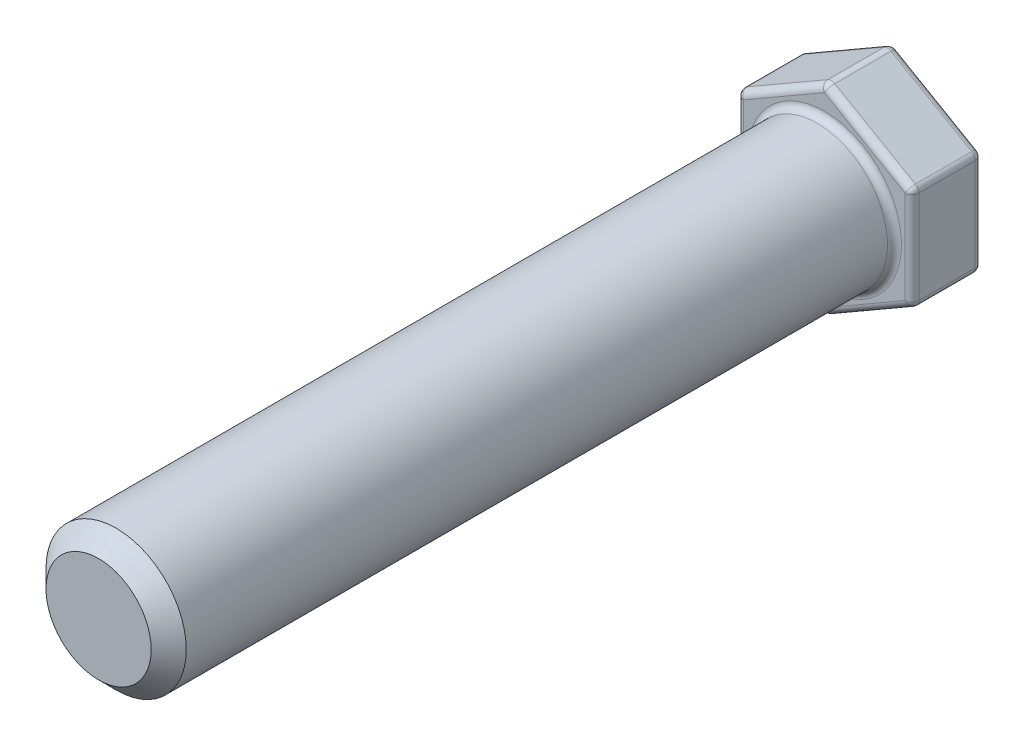
ISO-10303-21;
HEADER;
FILE_DESCRIPTION(('STEP AP214'),'2;1');
FILE_NAME('part.step','',(''),(''),'','','');
FILE_SCHEMA(('AUTOMOTIVE_DESIGN { 1 0 10303 214 1 1 1 1 }'));
ENDSEC;
DATA;
#1=APPLICATION_CONTEXT('core data for automotive mechanical design processes');
#2=APPLICATION_PROTOCOL_DEFINITION('international standard','automotive_design',2000,#1);
#3=PRODUCT_CONTEXT('',#1,'mechanical');
#4=PRODUCT('Part','Part','',(#3));
#5=PRODUCT_RELATED_PRODUCT_CATEGORY('part','',(#4));
#6=PRODUCT_DEFINITION_FORMATION('','',#4);
#7=PRODUCT_DEFINITION_CONTEXT('part definition',#1,'design');
#8=PRODUCT_DEFINITION('design','',#6,#7);
#9=PRODUCT_DEFINITION_SHAPE('','',#8);
#10=(LENGTH_UNIT() NAMED_UNIT(*) SI_UNIT(.MILLI.,.METRE.));
#11=(NAMED_UNIT(*) PLANE_ANGLE_UNIT() SI_UNIT($,.RADIAN.));
#12=(NAMED_UNIT(*) SI_UNIT($,.STERADIAN.) SOLID_ANGLE_UNIT());
#13=UNCERTAINTY_MEASURE_WITH_UNIT(LENGTH_MEASURE(1.E-05),#10,'distance_accuracy_value','');
#14=(GEOMETRIC_REPRESENTATION_CONTEXT(3) GLOBAL_UNCERTAINTY_ASSIGNED_CONTEXT((#13)) GLOBAL_UNIT_ASSIGNED_CONTEXT((#10,
#11,#12)) REPRESENTATION_CONTEXT('',''));
#15=CARTESIAN_POINT('',(0.,0.,0.));
#16=DIRECTION('',(0.,0.,1.));
#17=DIRECTION('',(1.,0.,0.));
#18=AXIS2_PLACEMENT_3D('',#15,#16,#17);
#19=CARTESIAN_POINT('',(0.,0.,20.7));
#20=DIRECTION('',(0.,0.,-1.));
#21=DIRECTION('',(-1.,0.,0.));
#22=AXIS2_PLACEMENT_3D('',#19,#20,#21);
#23=CYLINDRICAL_SURFACE('',#22,2.);
#24=CARTESIAN_POINT('',(0.,0.,20.2));
#25=DIRECTION('',(0.,0.,1.));
#26=DIRECTION('',(1.,0.,0.));
#27=AXIS2_PLACEMENT_3D('',#24,#25,#26);
#28=CIRCLE('',#27,2.);
#29=CARTESIAN_POINT('',(2.,0.,20.2));
#30=VERTEX_POINT('',#29);
#31=EDGE_CURVE('E11',#30,#30,#28,.F.);
#32=ORIENTED_EDGE('',*,*,#31,.T.);
#33=EDGE_LOOP('',(#32));
#34=FACE_BOUND('',#33,.T.);
#35=CARTESIAN_POINT('',(0.,0.,0.199999999999999));
#36=DIRECTION('',(0.,0.,-1.));
#37=DIRECTION('',(-1.,0.,0.));
#38=AXIS2_PLACEMENT_3D('',#35,#36,#37);
#39=CIRCLE('',#38,2.);
#40=CARTESIAN_POINT('',(-2.,0.,0.199999999999999));
#41=VERTEX_POINT('',#40);
#42=EDGE_CURVE('E291',#41,#41,#39,.F.);
#43=ORIENTED_EDGE('',*,*,#42,.T.);
#44=EDGE_LOOP('',(#43));
#45=FACE_BOUND('',#44,.T.);
#46=ADVANCED_FACE('F41',(#34,#45),#23,.T.);
#47=CARTESIAN_POINT('',(0.,0.,20.7));
#48=DIRECTION('',(0.,0.,1.));
#49=DIRECTION('',(1.,0.,0.));
#50=AXIS2_PLACEMENT_3D('',#47,#48,#49);
#51=PLANE('',#50);
#52=CARTESIAN_POINT('',(0.,0.,20.7));
#53=DIRECTION('',(0.,0.,1.));
#54=DIRECTION('',(1.,0.,0.));
#55=AXIS2_PLACEMENT_3D('',#52,#53,#54);
#56=CIRCLE('',#55,1.5);
#57=CARTESIAN_POINT('',(1.5,0.,20.7));
#58=VERTEX_POINT('',#57);
#59=EDGE_CURVE('E50',#58,#58,#56,.T.);
#60=ORIENTED_EDGE('',*,*,#59,.T.);
#61=EDGE_LOOP('',(#60));
#62=FACE_BOUND('',#61,.T.);
#63=ADVANCED_FACE('F440',(#62),#51,.T.);
#64=CARTESIAN_POINT('',(0.,2.88675134594813,-2.));
#65=DIRECTION('',(-0.500000000000001,-0.866025403784438,0.));
#66=DIRECTION('',(0.866025403784438,-0.500000000000001,0.));
#67=AXIS2_PLACEMENT_3D('',#64,#65,#66);
#68=PLANE('',#67);
#69=DIRECTION('',(0.866025403784438,-0.500000000000001,0.));
#70=VECTOR('',#69,1.);
#71=CARTESIAN_POINT('',(0.,2.88675134594813,-1.8));
#72=LINE('',#71,#70);
#73=CARTESIAN_POINT('',(2.4,1.50111069989303,-1.8));
#74=VERTEX_POINT('',#73);
#75=CARTESIAN_POINT('',(0.100000000000001,2.82901631902917,-1.8));
#76=VERTEX_POINT('',#75);
#77=EDGE_CURVE('E260',#74,#76,#72,.F.);
#78=ORIENTED_EDGE('',*,*,#77,.T.);
#79=DIRECTION('',(0.,0.,1.));
#80=VECTOR('',#79,1.);
#81=CARTESIAN_POINT('',(0.100000000000001,2.82901631902917,-2.));
#82=LINE('',#81,#80);
#83=CARTESIAN_POINT('',(0.100000000000001,2.82901631902917,-0.2));
#84=VERTEX_POINT('',#83);
#85=EDGE_CURVE('E363',#76,#84,#82,.T.);
#86=ORIENTED_EDGE('',*,*,#85,.T.);
#87=DIRECTION('',(0.866025403784438,-0.500000000000001,0.));
#88=VECTOR('',#87,1.);
#89=CARTESIAN_POINT('',(0.,2.88675134594813,-0.2));
#90=LINE('',#89,#88);
#91=CARTESIAN_POINT('',(2.4,1.50111069989303,-0.2));
#92=VERTEX_POINT('',#91);
#93=EDGE_CURVE('E256',#84,#92,#90,.T.);
#94=ORIENTED_EDGE('',*,*,#93,.T.);
#95=DIRECTION('',(0.,0.,1.));
#96=VECTOR('',#95,1.);
#97=CARTESIAN_POINT('',(2.4,1.50111069989303,-2.));
#98=LINE('',#97,#96);
#99=EDGE_CURVE('E360',#92,#74,#98,.F.);
#100=ORIENTED_EDGE('',*,*,#99,.T.);
#101=EDGE_LOOP('',(#78,#86,#94,#100));
#102=FACE_BOUND('',#101,.T.);
#103=ADVANCED_FACE('F458',(#102),#68,.F.);
#104=CARTESIAN_POINT('',(2.5,1.44337567297406,-2.));
#105=DIRECTION('',(-1.,0.,0.));
#106=DIRECTION('',(0.,0.,1.));
#107=AXIS2_PLACEMENT_3D('',#104,#105,#106);
#108=PLANE('',#107);
#109=DIRECTION('',(0.,-1.,0.));
#110=VECTOR('',#109,1.);
#111=CARTESIAN_POINT('',(2.5,1.44337567297406,-0.2));
#112=LINE('',#111,#110);
#113=CARTESIAN_POINT('',(2.5,1.32790561913614,-0.2));
#114=VERTEX_POINT('',#113);
#115=CARTESIAN_POINT('',(2.5,-1.32790561913614,-0.2));
#116=VERTEX_POINT('',#115);
#117=EDGE_CURVE('E250',#114,#116,#112,.T.);
#118=ORIENTED_EDGE('',*,*,#117,.T.);
#119=DIRECTION('',(0.,0.,1.));
#120=VECTOR('',#119,1.);
#121=CARTESIAN_POINT('',(2.5,-1.32790561913614,-2.));
#122=LINE('',#121,#120);
#123=CARTESIAN_POINT('',(2.5,-1.32790561913614,-1.8));
#124=VERTEX_POINT('',#123);
#125=EDGE_CURVE('E392',#116,#124,#122,.F.);
#126=ORIENTED_EDGE('',*,*,#125,.T.);
#127=DIRECTION('',(0.,-1.,0.));
#128=VECTOR('',#127,1.);
#129=CARTESIAN_POINT('',(2.5,1.44337567297406,-1.8));
#130=LINE('',#129,#128);
#131=CARTESIAN_POINT('',(2.5,1.32790561913614,-1.8));
#132=VERTEX_POINT('',#131);
#133=EDGE_CURVE('E253',#124,#132,#130,.F.);
#134=ORIENTED_EDGE('',*,*,#133,.T.);
#135=DIRECTION('',(0.,0.,1.));
#136=VECTOR('',#135,1.);
#137=CARTESIAN_POINT('',(2.5,1.32790561913614,-2.));
#138=LINE('',#137,#136);
#139=EDGE_CURVE('E64',#132,#114,#138,.T.);
#140=ORIENTED_EDGE('',*,*,#139,.T.);
#141=EDGE_LOOP('',(#118,#126,#134,#140));
#142=FACE_BOUND('',#141,.T.);
#143=ADVANCED_FACE('F624',(#142),#108,.F.);
#144=CARTESIAN_POINT('',(2.5,-1.44337567297406,-2.));
#145=DIRECTION('',(-0.5,0.866025403784439,0.));
#146=DIRECTION('',(-0.866025403784439,-0.5,0.));
#147=AXIS2_PLACEMENT_3D('',#144,#145,#146);
#148=PLANE('',#147);
#149=DIRECTION('',(-0.866025403784439,-0.5,0.));
#150=VECTOR('',#149,1.);
#151=CARTESIAN_POINT('',(2.5,-1.44337567297406,-0.2));
#152=LINE('',#151,#150);
#153=CARTESIAN_POINT('',(2.4,-1.50111069989303,-0.2));
#154=VERTEX_POINT('',#153);
#155=CARTESIAN_POINT('',(0.099999999999999,-2.82901631902917,-0.2));
#156=VERTEX_POINT('',#155);
#157=EDGE_CURVE('E242',#154,#156,#152,.T.);
#158=ORIENTED_EDGE('',*,*,#157,.T.);
#159=DIRECTION('',(0.,0.,1.));
#160=VECTOR('',#159,1.);
#161=CARTESIAN_POINT('',(0.1,-2.82901631902917,-2.));
#162=LINE('',#161,#160);
#163=CARTESIAN_POINT('',(0.099999999999999,-2.82901631902917,-1.8));
#164=VERTEX_POINT('',#163);
#165=EDGE_CURVE('E387',#156,#164,#162,.F.);
#166=ORIENTED_EDGE('',*,*,#165,.T.);
#167=DIRECTION('',(-0.866025403784439,-0.5,0.));
#168=VECTOR('',#167,1.);
#169=CARTESIAN_POINT('',(2.5,-1.44337567297406,-1.8));
#170=LINE('',#169,#168);
#171=CARTESIAN_POINT('',(2.4,-1.50111069989303,-1.8));
#172=VERTEX_POINT('',#171);
#173=EDGE_CURVE('E246',#164,#172,#170,.F.);
#174=ORIENTED_EDGE('',*,*,#173,.T.);
#175=DIRECTION('',(0.,0.,1.));
#176=VECTOR('',#175,1.);
#177=CARTESIAN_POINT('',(2.4,-1.50111069989303,-2.));
#178=LINE('',#177,#176);
#179=EDGE_CURVE('E384',#172,#154,#178,.T.);
#180=ORIENTED_EDGE('',*,*,#179,.T.);
#181=EDGE_LOOP('',(#158,#166,#174,#180));
#182=FACE_BOUND('',#181,.T.);
#183=ADVANCED_FACE('F620',(#182),#148,.F.);
#184=CARTESIAN_POINT('',(0.,-2.88675134594813,-2.));
#185=DIRECTION('',(0.5,0.866025403784438,0.));
#186=DIRECTION('',(-0.866025403784438,0.5,0.));
#187=AXIS2_PLACEMENT_3D('',#184,#185,#186);
#188=PLANE('',#187);
#189=DIRECTION('',(-0.866025403784438,0.5,0.));
#190=VECTOR('',#189,1.);
#191=CARTESIAN_POINT('',(0.,-2.88675134594813,-0.2));
#192=LINE('',#191,#190);
#193=CARTESIAN_POINT('',(-0.0999999999999999,-2.82901631902917,-0.2));
#194=VERTEX_POINT('',#193);
#195=CARTESIAN_POINT('',(-2.4,-1.50111069989303,-0.2));
#196=VERTEX_POINT('',#195);
#197=EDGE_CURVE('E234',#194,#196,#192,.T.);
#198=ORIENTED_EDGE('',*,*,#197,.T.);
#199=DIRECTION('',(0.,0.,1.));
#200=VECTOR('',#199,1.);
#201=CARTESIAN_POINT('',(-2.4,-1.50111069989303,-2.));
#202=LINE('',#201,#200);
#203=CARTESIAN_POINT('',(-2.4,-1.50111069989303,-1.8));
#204=VERTEX_POINT('',#203);
#205=EDGE_CURVE('E381',#196,#204,#202,.F.);
#206=ORIENTED_EDGE('',*,*,#205,.T.);
#207=DIRECTION('',(-0.866025403784438,0.5,0.));
#208=VECTOR('',#207,1.);
#209=CARTESIAN_POINT('',(0.,-2.88675134594813,-1.8));
#210=LINE('',#209,#208);
#211=CARTESIAN_POINT('',(-0.0999999999999998,-2.82901631902917,-1.8));
#212=VERTEX_POINT('',#211);
#213=EDGE_CURVE('E238',#204,#212,#210,.F.);
#214=ORIENTED_EDGE('',*,*,#213,.T.);
#215=DIRECTION('',(0.,0.,1.));
#216=VECTOR('',#215,1.);
#217=CARTESIAN_POINT('',(-0.0999999999999999,-2.82901631902917,-2.));
#218=LINE('',#217,#216);
#219=EDGE_CURVE('E378',#212,#194,#218,.T.);
#220=ORIENTED_EDGE('',*,*,#219,.T.);
#221=EDGE_LOOP('',(#198,#206,#214,#220));
#222=FACE_BOUND('',#221,.T.);
#223=ADVANCED_FACE('F614',(#222),#188,.F.);
#224=CARTESIAN_POINT('',(-2.5,-1.44337567297406,-2.));
#225=DIRECTION('',(1.,0.,0.));
#226=DIRECTION('',(0.,1.,0.));
#227=AXIS2_PLACEMENT_3D('',#224,#225,#226);
#228=PLANE('',#227);
#229=DIRECTION('',(0.,1.,0.));
#230=VECTOR('',#229,1.);
#231=CARTESIAN_POINT('',(-2.5,-1.44337567297406,-0.2));
#232=LINE('',#231,#230);
#233=CARTESIAN_POINT('',(-2.5,-1.32790561913614,-0.2));
#234=VERTEX_POINT('',#233);
#235=CARTESIAN_POINT('',(-2.5,1.32790561913614,-0.2));
#236=VERTEX_POINT('',#235);
#237=EDGE_CURVE('E226',#234,#236,#232,.T.);
#238=ORIENTED_EDGE('',*,*,#237,.T.);
#239=DIRECTION('',(0.,0.,1.));
#240=VECTOR('',#239,1.);
#241=CARTESIAN_POINT('',(-2.5,1.32790561913614,-2.));
#242=LINE('',#241,#240);
#243=CARTESIAN_POINT('',(-2.5,1.32790561913614,-1.8));
#244=VERTEX_POINT('',#243);
#245=EDGE_CURVE('E375',#236,#244,#242,.F.);
#246=ORIENTED_EDGE('',*,*,#245,.T.);
#247=DIRECTION('',(0.,1.,0.));
#248=VECTOR('',#247,1.);
#249=CARTESIAN_POINT('',(-2.5,-1.44337567297406,-1.8));
#250=LINE('',#249,#248);
#251=CARTESIAN_POINT('',(-2.5,-1.32790561913614,-1.8));
#252=VERTEX_POINT('',#251);
#253=EDGE_CURVE('E230',#244,#252,#250,.F.);
#254=ORIENTED_EDGE('',*,*,#253,.T.);
#255=DIRECTION('',(0.,0.,1.));
#256=VECTOR('',#255,1.);
#257=CARTESIAN_POINT('',(-2.5,-1.32790561913614,-2.));
#258=LINE('',#257,#256);
#259=EDGE_CURVE('E372',#252,#234,#258,.T.);
#260=ORIENTED_EDGE('',*,*,#259,.T.);
#261=EDGE_LOOP('',(#238,#246,#254,#260));
#262=FACE_BOUND('',#261,.T.);
#263=ADVANCED_FACE('F601',(#262),#228,.F.);
#264=CARTESIAN_POINT('',(-2.5,1.44337567297407,-2.));
#265=DIRECTION('',(0.5,-0.866025403784439,0.));
#266=DIRECTION('',(0.866025403784439,0.5,0.));
#267=AXIS2_PLACEMENT_3D('',#264,#265,#266);
#268=PLANE('',#267);
#269=DIRECTION('',(0.866025403784439,0.5,0.));
#270=VECTOR('',#269,1.);
#271=CARTESIAN_POINT('',(-2.5,1.44337567297407,-0.2));
#272=LINE('',#271,#270);
#273=CARTESIAN_POINT('',(-2.4,1.50111069989303,-0.2));
#274=VERTEX_POINT('',#273);
#275=CARTESIAN_POINT('',(-0.099999999999999,2.82901631902917,-0.2));
#276=VERTEX_POINT('',#275);
#277=EDGE_CURVE('E214',#274,#276,#272,.T.);
#278=ORIENTED_EDGE('',*,*,#277,.T.);
#279=DIRECTION('',(0.,0.,1.));
#280=VECTOR('',#279,1.);
#281=CARTESIAN_POINT('',(-0.0999999999999994,2.82901631902917,-2.));
#282=LINE('',#281,#280);
#283=CARTESIAN_POINT('',(-0.0999999999999985,2.82901631902917,-1.8));
#284=VERTEX_POINT('',#283);
#285=EDGE_CURVE('E369',#276,#284,#282,.F.);
#286=ORIENTED_EDGE('',*,*,#285,.T.);
#287=DIRECTION('',(0.866025403784439,0.5,0.));
#288=VECTOR('',#287,1.);
#289=CARTESIAN_POINT('',(-2.5,1.44337567297407,-1.8));
#290=LINE('',#289,#288);
#291=CARTESIAN_POINT('',(-2.4,1.50111069989303,-1.8));
#292=VERTEX_POINT('',#291);
#293=EDGE_CURVE('E192',#284,#292,#290,.F.);
#294=ORIENTED_EDGE('',*,*,#293,.T.);
#295=DIRECTION('',(0.,0.,1.));
#296=VECTOR('',#295,1.);
#297=CARTESIAN_POINT('',(-2.4,1.50111069989303,-2.));
#298=LINE('',#297,#296);
#299=EDGE_CURVE('E366',#292,#274,#298,.T.);
#300=ORIENTED_EDGE('',*,*,#299,.T.);
#301=EDGE_LOOP('',(#278,#286,#294,#300));
#302=FACE_BOUND('',#301,.T.);
#303=ADVANCED_FACE('F606',(#302),#268,.F.);
#304=CARTESIAN_POINT('',(0.,0.,-2.));
#305=DIRECTION('',(0.,0.,-1.));
#306=DIRECTION('',(-1.,0.,0.));
#307=AXIS2_PLACEMENT_3D('',#304,#305,#306);
#308=PLANE('',#307);
#309=DIRECTION('',(0.,1.,0.));
#310=VECTOR('',#309,1.);
#311=CARTESIAN_POINT('',(-2.3,1.44337567297407,-2.));
#312=LINE('',#311,#310);
#313=CARTESIAN_POINT('',(-2.3,-1.32790561913614,-2.));
#314=VERTEX_POINT('',#313);
#315=CARTESIAN_POINT('',(-2.3,1.32790561913614,-2.));
#316=VERTEX_POINT('',#315);
#317=EDGE_CURVE('E212',#314,#316,#312,.T.);
#318=ORIENTED_EDGE('',*,*,#317,.T.);
#319=DIRECTION('',(0.866025403784439,0.5,0.));
#320=VECTOR('',#319,1.);
#321=CARTESIAN_POINT('',(0.100000000000001,2.71354626519124,-2.));
#322=LINE('',#321,#320);
#323=CARTESIAN_POINT('',(0.,2.65581123827228,-2.));
#324=VERTEX_POINT('',#323);
#325=EDGE_CURVE('E189',#316,#324,#322,.T.);
#326=ORIENTED_EDGE('',*,*,#325,.T.);
#327=DIRECTION('',(0.866025403784438,-0.500000000000001,0.));
#328=VECTOR('',#327,1.);
#329=CARTESIAN_POINT('',(2.4,1.27017059221718,-2.));
#330=LINE('',#329,#328);
#331=CARTESIAN_POINT('',(2.3,1.32790561913614,-2.));
#332=VERTEX_POINT('',#331);
#333=EDGE_CURVE('E198',#324,#332,#330,.T.);
#334=ORIENTED_EDGE('',*,*,#333,.T.);
#335=DIRECTION('',(0.,-1.,0.));
#336=VECTOR('',#335,1.);
#337=CARTESIAN_POINT('',(2.3,-1.44337567297406,-2.));
#338=LINE('',#337,#336);
#339=CARTESIAN_POINT('',(2.3,-1.32790561913614,-2.));
#340=VERTEX_POINT('',#339);
#341=EDGE_CURVE('E205',#332,#340,#338,.T.);
#342=ORIENTED_EDGE('',*,*,#341,.T.);
#343=DIRECTION('',(-0.866025403784439,-0.5,0.));
#344=VECTOR('',#343,1.);
#345=CARTESIAN_POINT('',(-0.1,-2.71354626519124,-2.));
#346=LINE('',#345,#344);
#347=CARTESIAN_POINT('',(0.,-2.65581123827228,-2.));
#348=VERTEX_POINT('',#347);
#349=EDGE_CURVE('E906',#340,#348,#346,.T.);
#350=ORIENTED_EDGE('',*,*,#349,.T.);
#351=DIRECTION('',(-0.866025403784438,0.5,0.));
#352=VECTOR('',#351,1.);
#353=CARTESIAN_POINT('',(-2.4,-1.27017059221718,-2.));
#354=LINE('',#353,#352);
#355=EDGE_CURVE('E220',#348,#314,#354,.T.);
#356=ORIENTED_EDGE('',*,*,#355,.T.);
#357=EDGE_LOOP('',(#318,#326,#334,#342,#350,#356));
#358=FACE_BOUND('',#357,.T.);
#359=ADVANCED_FACE('F209',(#358),#308,.T.);
#360=CARTESIAN_POINT('',(0.,0.,0.));
#361=DIRECTION('',(0.,0.,-1.));
#362=DIRECTION('',(-1.,0.,0.));
#363=AXIS2_PLACEMENT_3D('',#360,#361,#362);
#364=PLANE('',#363);
#365=DIRECTION('',(-0.866025403784439,-0.5,0.));
#366=VECTOR('',#365,1.);
#367=CARTESIAN_POINT('',(1.15,-1.99185842870421,0.));
#368=LINE('',#367,#366);
#369=CARTESIAN_POINT('',(0.,-2.65581123827228,0.));
#370=VERTEX_POINT('',#369);
#371=CARTESIAN_POINT('',(2.3,-1.32790561913614,0.));
#372=VERTEX_POINT('',#371);
#373=EDGE_CURVE('E283',#370,#372,#368,.F.);
#374=ORIENTED_EDGE('',*,*,#373,.T.);
#375=DIRECTION('',(0.,-1.,0.));
#376=VECTOR('',#375,1.);
#377=CARTESIAN_POINT('',(2.3,0.,0.));
#378=LINE('',#377,#376);
#379=CARTESIAN_POINT('',(2.3,1.32790561913614,0.));
#380=VERTEX_POINT('',#379);
#381=EDGE_CURVE('E287',#372,#380,#378,.F.);
#382=ORIENTED_EDGE('',*,*,#381,.T.);
#383=DIRECTION('',(0.866025403784438,-0.500000000000001,0.));
#384=VECTOR('',#383,1.);
#385=CARTESIAN_POINT('',(1.15,1.99185842870421,0.));
#386=LINE('',#385,#384);
#387=CARTESIAN_POINT('',(0.,2.65581123827228,0.));
#388=VERTEX_POINT('',#387);
#389=EDGE_CURVE('E267',#380,#388,#386,.F.);
#390=ORIENTED_EDGE('',*,*,#389,.T.);
#391=DIRECTION('',(0.866025403784439,0.5,0.));
#392=VECTOR('',#391,1.);
#393=CARTESIAN_POINT('',(-1.15,1.99185842870421,0.));
#394=LINE('',#393,#392);
#395=CARTESIAN_POINT('',(-2.3,1.32790561913614,0.));
#396=VERTEX_POINT('',#395);
#397=EDGE_CURVE('E271',#388,#396,#394,.F.);
#398=ORIENTED_EDGE('',*,*,#397,.T.);
#399=DIRECTION('',(0.,1.,0.));
#400=VECTOR('',#399,1.);
#401=CARTESIAN_POINT('',(-2.3,0.,0.));
#402=LINE('',#401,#400);
#403=CARTESIAN_POINT('',(-2.3,-1.32790561913614,0.));
#404=VERTEX_POINT('',#403);
#405=EDGE_CURVE('E275',#396,#404,#402,.F.);
#406=ORIENTED_EDGE('',*,*,#405,.T.);
#407=DIRECTION('',(-0.866025403784438,0.5,0.));
#408=VECTOR('',#407,1.);
#409=CARTESIAN_POINT('',(-1.15,-1.99185842870421,0.));
#410=LINE('',#409,#408);
#411=EDGE_CURVE('E279',#404,#370,#410,.F.);
#412=ORIENTED_EDGE('',*,*,#411,.T.);
#413=EDGE_LOOP('',(#374,#382,#390,#398,#406,#412));
#414=FACE_BOUND('',#413,.T.);
#415=CARTESIAN_POINT('',(0.,0.,0.));
#416=DIRECTION('',(0.,0.,-1.));
#417=DIRECTION('',(-1.,0.,0.));
#418=AXIS2_PLACEMENT_3D('',#415,#416,#417);
#419=CIRCLE('',#418,2.2);
#420=CARTESIAN_POINT('',(-2.2,0.,0.));
#421=VERTEX_POINT('',#420);
#422=EDGE_CURVE('E263',#421,#421,#419,.T.);
#423=ORIENTED_EDGE('',*,*,#422,.T.);
#424=EDGE_LOOP('',(#423));
#425=FACE_BOUND('',#424,.T.);
#426=ADVANCED_FACE('F483',(#414,#425),#364,.F.);
#427=CARTESIAN_POINT('',(1.15,-1.99185842870421,-1.8));
#428=DIRECTION('',(0.866025403784439,0.5,0.));
#429=DIRECTION('',(-0.5,0.866025403784439,0.));
#430=AXIS2_PLACEMENT_3D('',#427,#428,#429);
#431=CYLINDRICAL_SURFACE('',#430,0.2);
#432=ORIENTED_EDGE('',*,*,#173,.F.);
#433=CARTESIAN_POINT('',(0.,-2.65581123827228,-1.8));
#434=DIRECTION('',(0.866025403784439,0.5,0.));
#435=DIRECTION('',(-0.5,0.866025403784439,0.));
#436=AXIS2_PLACEMENT_3D('',#433,#434,#435);
#437=CIRCLE('',#436,0.2);
#438=EDGE_CURVE('E339',#164,#348,#437,.T.);
#439=ORIENTED_EDGE('',*,*,#438,.T.);
#440=ORIENTED_EDGE('',*,*,#349,.F.);
#441=CARTESIAN_POINT('',(2.3,-1.32790561913614,-1.8));
#442=DIRECTION('',(0.866025403784439,0.5,0.));
#443=DIRECTION('',(-0.5,0.866025403784439,0.));
#444=AXIS2_PLACEMENT_3D('',#441,#442,#443);
#445=CIRCLE('',#444,0.2);
#446=EDGE_CURVE('E336',#340,#172,#445,.F.);
#447=ORIENTED_EDGE('',*,*,#446,.T.);
#448=EDGE_LOOP('',(#432,#439,#440,#447));
#449=FACE_BOUND('',#448,.T.);
#450=ADVANCED_FACE('F479',(#449),#431,.T.);
#451=CARTESIAN_POINT('',(-1.15,-1.99185842870421,-1.8));
#452=DIRECTION('',(0.866025403784438,-0.5,0.));
#453=DIRECTION('',(0.5,0.866025403784438,0.));
#454=AXIS2_PLACEMENT_3D('',#451,#452,#453);
#455=CYLINDRICAL_SURFACE('',#454,0.2);
#456=ORIENTED_EDGE('',*,*,#213,.F.);
#457=CARTESIAN_POINT('',(-2.3,-1.32790561913614,-1.8));
#458=DIRECTION('',(0.866025403784438,-0.5,0.));
#459=DIRECTION('',(0.5,0.866025403784438,0.));
#460=AXIS2_PLACEMENT_3D('',#457,#458,#459);
#461=CIRCLE('',#460,0.2);
#462=EDGE_CURVE('E327',#204,#314,#461,.T.);
#463=ORIENTED_EDGE('',*,*,#462,.T.);
#464=ORIENTED_EDGE('',*,*,#355,.F.);
#465=CARTESIAN_POINT('',(0.,-2.65581123827228,-1.8));
#466=DIRECTION('',(0.866025403784438,-0.5,0.));
#467=DIRECTION('',(0.5,0.866025403784438,0.));
#468=AXIS2_PLACEMENT_3D('',#465,#466,#467);
#469=CIRCLE('',#468,0.2);
#470=EDGE_CURVE('E323',#348,#212,#469,.F.);
#471=ORIENTED_EDGE('',*,*,#470,.T.);
#472=EDGE_LOOP('',(#456,#463,#464,#471));
#473=FACE_BOUND('',#472,.T.);
#474=ADVANCED_FACE('F475',(#473),#455,.T.);
#475=CARTESIAN_POINT('',(2.3,0.,-1.8));
#476=DIRECTION('',(0.,1.,0.));
#477=DIRECTION('',(0.,0.,1.));
#478=AXIS2_PLACEMENT_3D('',#475,#476,#477);
#479=CYLINDRICAL_SURFACE('',#478,0.2);
#480=ORIENTED_EDGE('',*,*,#133,.F.);
#481=CARTESIAN_POINT('',(2.3,-1.32790561913614,-1.8));
#482=DIRECTION('',(0.,1.,0.));
#483=DIRECTION('',(0.,0.,1.));
#484=AXIS2_PLACEMENT_3D('',#481,#482,#483);
#485=CIRCLE('',#484,0.2);
#486=EDGE_CURVE('E351',#124,#340,#485,.T.);
#487=ORIENTED_EDGE('',*,*,#486,.T.);
#488=ORIENTED_EDGE('',*,*,#341,.F.);
#489=CARTESIAN_POINT('',(2.3,1.32790561913614,-1.8));
#490=DIRECTION('',(0.,1.,0.));
#491=DIRECTION('',(0.,0.,1.));
#492=AXIS2_PLACEMENT_3D('',#489,#490,#491);
#493=CIRCLE('',#492,0.2);
#494=EDGE_CURVE('E348',#332,#132,#493,.F.);
#495=ORIENTED_EDGE('',*,*,#494,.T.);
#496=EDGE_LOOP('',(#480,#487,#488,#495));
#497=FACE_BOUND('',#496,.T.);
#498=ADVANCED_FACE('F471',(#497),#479,.T.);
#499=CARTESIAN_POINT('',(-2.3,0.,-1.8));
#500=DIRECTION('',(0.,-1.,0.));
#501=DIRECTION('',(1.,0.,0.));
#502=AXIS2_PLACEMENT_3D('',#499,#500,#501);
#503=CYLINDRICAL_SURFACE('',#502,0.2);
#504=ORIENTED_EDGE('',*,*,#253,.F.);
#505=CARTESIAN_POINT('',(-2.3,1.32790561913614,-1.8));
#506=DIRECTION('',(0.,-1.,0.));
#507=DIRECTION('',(1.,0.,0.));
#508=AXIS2_PLACEMENT_3D('',#505,#506,#507);
#509=CIRCLE('',#508,0.2);
#510=EDGE_CURVE('E314',#244,#316,#509,.T.);
#511=ORIENTED_EDGE('',*,*,#510,.T.);
#512=ORIENTED_EDGE('',*,*,#317,.F.);
#513=CARTESIAN_POINT('',(-2.3,-1.32790561913614,-1.8));
#514=DIRECTION('',(0.,-1.,0.));
#515=DIRECTION('',(1.,0.,0.));
#516=AXIS2_PLACEMENT_3D('',#513,#514,#515);
#517=CIRCLE('',#516,0.2);
#518=EDGE_CURVE('E310',#314,#252,#517,.F.);
#519=ORIENTED_EDGE('',*,*,#518,.T.);
#520=EDGE_LOOP('',(#504,#511,#512,#519));
#521=FACE_BOUND('',#520,.T.);
#522=ADVANCED_FACE('F468',(#521),#503,.T.);
#523=CARTESIAN_POINT('',(1.15,1.99185842870421,-1.8));
#524=DIRECTION('',(-0.866025403784438,0.500000000000001,0.));
#525=DIRECTION('',(-0.500000000000001,-0.866025403784438,0.));
#526=AXIS2_PLACEMENT_3D('',#523,#524,#525);
#527=CYLINDRICAL_SURFACE('',#526,0.2);
#528=ORIENTED_EDGE('',*,*,#333,.F.);
#529=CARTESIAN_POINT('',(0.,2.65581123827228,-1.8));
#530=DIRECTION('',(-0.866025403784438,0.500000000000001,0.));
#531=DIRECTION('',(-0.500000000000001,-0.866025403784438,0.));
#532=AXIS2_PLACEMENT_3D('',#529,#530,#531);
#533=CIRCLE('',#532,0.2);
#534=EDGE_CURVE('E169',#324,#76,#533,.F.);
#535=ORIENTED_EDGE('',*,*,#534,.T.);
#536=ORIENTED_EDGE('',*,*,#77,.F.);
#537=CARTESIAN_POINT('',(2.3,1.32790561913614,-1.8));
#538=DIRECTION('',(-0.866025403784438,0.500000000000001,0.));
#539=DIRECTION('',(-0.500000000000001,-0.866025403784438,0.));
#540=AXIS2_PLACEMENT_3D('',#537,#538,#539);
#541=CIRCLE('',#540,0.2);
#542=EDGE_CURVE('E181',#74,#332,#541,.T.);
#543=ORIENTED_EDGE('',*,*,#542,.T.);
#544=EDGE_LOOP('',(#528,#535,#536,#543));
#545=FACE_BOUND('',#544,.T.);
#546=ADVANCED_FACE('F199',(#545),#527,.T.);
#547=CARTESIAN_POINT('',(-1.15,1.99185842870421,-1.8));
#548=DIRECTION('',(-0.866025403784439,-0.5,0.));
#549=DIRECTION('',(0.5,-0.866025403784439,0.));
#550=AXIS2_PLACEMENT_3D('',#547,#548,#549);
#551=CYLINDRICAL_SURFACE('',#550,0.2);
#552=ORIENTED_EDGE('',*,*,#293,.F.);
#553=CARTESIAN_POINT('',(0.,2.65581123827228,-1.8));
#554=DIRECTION('',(-0.866025403784439,-0.5,0.));
#555=DIRECTION('',(0.5,-0.866025403784439,0.));
#556=AXIS2_PLACEMENT_3D('',#553,#554,#555);
#557=CIRCLE('',#556,0.2);
#558=EDGE_CURVE('E172',#284,#324,#557,.T.);
#559=ORIENTED_EDGE('',*,*,#558,.T.);
#560=ORIENTED_EDGE('',*,*,#325,.F.);
#561=CARTESIAN_POINT('',(-2.3,1.32790561913614,-1.8));
#562=DIRECTION('',(-0.866025403784439,-0.5,0.));
#563=DIRECTION('',(0.5,-0.866025403784439,0.));
#564=AXIS2_PLACEMENT_3D('',#561,#562,#563);
#565=CIRCLE('',#564,0.2);
#566=EDGE_CURVE('E194',#316,#292,#565,.F.);
#567=ORIENTED_EDGE('',*,*,#566,.T.);
#568=EDGE_LOOP('',(#552,#559,#560,#567));
#569=FACE_BOUND('',#568,.T.);
#570=ADVANCED_FACE('F186',(#569),#551,.T.);
#571=CARTESIAN_POINT('',(-2.3,-1.44337567297406,-0.2));
#572=DIRECTION('',(0.,1.,0.));
#573=DIRECTION('',(-1.,0.,0.));
#574=AXIS2_PLACEMENT_3D('',#571,#572,#573);
#575=CYLINDRICAL_SURFACE('',#574,0.2);
#576=ORIENTED_EDGE('',*,*,#405,.F.);
#577=CARTESIAN_POINT('',(-2.3,1.32790561913614,-0.2));
#578=DIRECTION('',(0.,1.,0.));
#579=DIRECTION('',(-1.,0.,0.));
#580=AXIS2_PLACEMENT_3D('',#577,#578,#579);
#581=CIRCLE('',#580,0.2);
#582=EDGE_CURVE('E320',#396,#236,#581,.F.);
#583=ORIENTED_EDGE('',*,*,#582,.T.);
#584=ORIENTED_EDGE('',*,*,#237,.F.);
#585=CARTESIAN_POINT('',(-2.3,-1.32790561913614,-0.2));
#586=DIRECTION('',(0.,1.,0.));
#587=DIRECTION('',(-1.,0.,0.));
#588=AXIS2_PLACEMENT_3D('',#585,#586,#587);
#589=CIRCLE('',#588,0.2);
#590=EDGE_CURVE('E317',#234,#404,#589,.T.);
#591=ORIENTED_EDGE('',*,*,#590,.T.);
#592=EDGE_LOOP('',(#576,#583,#584,#591));
#593=FACE_BOUND('',#592,.T.);
#594=ADVANCED_FACE('F465',(#593),#575,.T.);
#595=CARTESIAN_POINT('',(-2.4,1.27017059221718,-0.2));
#596=DIRECTION('',(0.866025403784439,0.5,0.));
#597=DIRECTION('',(-0.5,0.866025403784439,0.));
#598=AXIS2_PLACEMENT_3D('',#595,#596,#597);
#599=CYLINDRICAL_SURFACE('',#598,0.2);
#600=ORIENTED_EDGE('',*,*,#397,.F.);
#601=CARTESIAN_POINT('',(0.,2.65581123827228,-0.2));
#602=DIRECTION('',(0.866025403784439,0.5,0.));
#603=DIRECTION('',(-0.5,0.866025403784439,0.));
#604=AXIS2_PLACEMENT_3D('',#601,#602,#603);
#605=CIRCLE('',#604,0.2);
#606=EDGE_CURVE('E307',#388,#276,#605,.F.);
#607=ORIENTED_EDGE('',*,*,#606,.T.);
#608=ORIENTED_EDGE('',*,*,#277,.F.);
#609=CARTESIAN_POINT('',(-2.3,1.32790561913614,-0.2));
#610=DIRECTION('',(0.866025403784439,0.5,0.));
#611=DIRECTION('',(-0.5,0.866025403784439,0.));
#612=AXIS2_PLACEMENT_3D('',#609,#610,#611);
#613=CIRCLE('',#612,0.2);
#614=EDGE_CURVE('E304',#274,#396,#613,.T.);
#615=ORIENTED_EDGE('',*,*,#614,.T.);
#616=EDGE_LOOP('',(#600,#607,#608,#615));
#617=FACE_BOUND('',#616,.T.);
#618=ADVANCED_FACE('F500',(#617),#599,.T.);
#619=CARTESIAN_POINT('',(0.1,-2.71354626519124,-0.2));
#620=DIRECTION('',(-0.866025403784438,0.5,0.));
#621=DIRECTION('',(-0.5,-0.866025403784438,0.));
#622=AXIS2_PLACEMENT_3D('',#619,#620,#621);
#623=CYLINDRICAL_SURFACE('',#622,0.2);
#624=ORIENTED_EDGE('',*,*,#411,.F.);
#625=CARTESIAN_POINT('',(-2.3,-1.32790561913614,-0.2));
#626=DIRECTION('',(-0.866025403784438,0.5,0.));
#627=DIRECTION('',(-0.5,-0.866025403784438,0.));
#628=AXIS2_PLACEMENT_3D('',#625,#626,#627);
#629=CIRCLE('',#628,0.2);
#630=EDGE_CURVE('E333',#404,#196,#629,.F.);
#631=ORIENTED_EDGE('',*,*,#630,.T.);
#632=ORIENTED_EDGE('',*,*,#197,.F.);
#633=CARTESIAN_POINT('',(0.,-2.65581123827228,-0.2));
#634=DIRECTION('',(-0.866025403784438,0.5,0.));
#635=DIRECTION('',(-0.5,-0.866025403784438,0.));
#636=AXIS2_PLACEMENT_3D('',#633,#634,#635);
#637=CIRCLE('',#636,0.2);
#638=EDGE_CURVE('E330',#194,#370,#637,.T.);
#639=ORIENTED_EDGE('',*,*,#638,.T.);
#640=EDGE_LOOP('',(#624,#631,#632,#639));
#641=FACE_BOUND('',#640,.T.);
#642=ADVANCED_FACE('F496',(#641),#623,.T.);
#643=CARTESIAN_POINT('',(-0.0999999999999993,2.71354626519124,-0.2));
#644=DIRECTION('',(0.866025403784438,-0.500000000000001,0.));
#645=DIRECTION('',(0.500000000000001,0.866025403784438,0.));
#646=AXIS2_PLACEMENT_3D('',#643,#644,#645);
#647=CYLINDRICAL_SURFACE('',#646,0.2);
#648=ORIENTED_EDGE('',*,*,#93,.F.);
#649=CARTESIAN_POINT('',(0.,2.65581123827228,-0.2));
#650=DIRECTION('',(0.866025403784438,-0.500000000000001,0.));
#651=DIRECTION('',(0.500000000000001,0.866025403784438,0.));
#652=AXIS2_PLACEMENT_3D('',#649,#650,#651);
#653=CIRCLE('',#652,0.2);
#654=EDGE_CURVE('E301',#84,#388,#653,.T.);
#655=ORIENTED_EDGE('',*,*,#654,.T.);
#656=ORIENTED_EDGE('',*,*,#389,.F.);
#657=CARTESIAN_POINT('',(2.3,1.32790561913614,-0.2));
#658=DIRECTION('',(0.866025403784438,-0.500000000000001,0.));
#659=DIRECTION('',(0.500000000000001,0.866025403784438,0.));
#660=AXIS2_PLACEMENT_3D('',#657,#658,#659);
#661=CIRCLE('',#660,0.2);
#662=EDGE_CURVE('E180',#380,#92,#661,.F.);
#663=ORIENTED_EDGE('',*,*,#662,.T.);
#664=EDGE_LOOP('',(#648,#655,#656,#663));
#665=FACE_BOUND('',#664,.T.);
#666=ADVANCED_FACE('F492',(#665),#647,.T.);
#667=CARTESIAN_POINT('',(2.4,-1.27017059221718,-0.2));
#668=DIRECTION('',(-0.866025403784439,-0.5,0.));
#669=DIRECTION('',(0.5,-0.866025403784439,0.));
#670=AXIS2_PLACEMENT_3D('',#667,#668,#669);
#671=CYLINDRICAL_SURFACE('',#670,0.2);
#672=ORIENTED_EDGE('',*,*,#373,.F.);
#673=CARTESIAN_POINT('',(0.,-2.65581123827228,-0.2));
#674=DIRECTION('',(-0.866025403784439,-0.5,0.));
#675=DIRECTION('',(0.5,-0.866025403784439,0.));
#676=AXIS2_PLACEMENT_3D('',#673,#674,#675);
#677=CIRCLE('',#676,0.2);
#678=EDGE_CURVE('E345',#370,#156,#677,.F.);
#679=ORIENTED_EDGE('',*,*,#678,.T.);
#680=ORIENTED_EDGE('',*,*,#157,.F.);
#681=CARTESIAN_POINT('',(2.3,-1.32790561913614,-0.2));
#682=DIRECTION('',(-0.866025403784439,-0.5,0.));
#683=DIRECTION('',(0.5,-0.866025403784439,0.));
#684=AXIS2_PLACEMENT_3D('',#681,#682,#683);
#685=CIRCLE('',#684,0.2);
#686=EDGE_CURVE('E342',#154,#372,#685,.T.);
#687=ORIENTED_EDGE('',*,*,#686,.T.);
#688=EDGE_LOOP('',(#672,#679,#680,#687));
#689=FACE_BOUND('',#688,.T.);
#690=ADVANCED_FACE('F489',(#689),#671,.T.);
#691=CARTESIAN_POINT('',(2.3,1.44337567297406,-0.2));
#692=DIRECTION('',(0.,-1.,0.));
#693=DIRECTION('',(0.,0.,-1.));
#694=AXIS2_PLACEMENT_3D('',#691,#692,#693);
#695=CYLINDRICAL_SURFACE('',#694,0.2);
#696=ORIENTED_EDGE('',*,*,#381,.F.);
#697=CARTESIAN_POINT('',(2.3,-1.32790561913614,-0.2));
#698=DIRECTION('',(0.,-1.,0.));
#699=DIRECTION('',(0.,0.,-1.));
#700=AXIS2_PLACEMENT_3D('',#697,#698,#699);
#701=CIRCLE('',#700,0.2);
#702=EDGE_CURVE('E57',#372,#116,#701,.F.);
#703=ORIENTED_EDGE('',*,*,#702,.T.);
#704=ORIENTED_EDGE('',*,*,#117,.F.);
#705=CARTESIAN_POINT('',(2.3,1.32790561913614,-0.2));
#706=DIRECTION('',(0.,-1.,0.));
#707=DIRECTION('',(0.,0.,-1.));
#708=AXIS2_PLACEMENT_3D('',#705,#706,#707);
#709=CIRCLE('',#708,0.2);
#710=EDGE_CURVE('E355',#114,#380,#709,.T.);
#711=ORIENTED_EDGE('',*,*,#710,.T.);
#712=EDGE_LOOP('',(#696,#703,#704,#711));
#713=FACE_BOUND('',#712,.T.);
#714=ADVANCED_FACE('F485',(#713),#695,.T.);
#715=CARTESIAN_POINT('',(0.,0.,0.199999999999999));
#716=DIRECTION('',(0.,0.,-1.));
#717=DIRECTION('',(-1.,0.,0.));
#718=AXIS2_PLACEMENT_3D('',#715,#716,#717);
#719=TOROIDAL_SURFACE('',#718,2.2,0.2);
#720=ORIENTED_EDGE('',*,*,#422,.F.);
#721=EDGE_LOOP('',(#720));
#722=FACE_BOUND('',#721,.T.);
#723=ORIENTED_EDGE('',*,*,#42,.F.);
#724=EDGE_LOOP('',(#723));
#725=FACE_BOUND('',#724,.T.);
#726=ADVANCED_FACE('F488',(#722,#725),#719,.F.);
#727=CARTESIAN_POINT('',(0.,2.65581123827228,-0.2));
#728=DIRECTION('',(0.,0.,1.));
#729=DIRECTION('',(1.,0.,0.));
#730=AXIS2_PLACEMENT_3D('',#727,#728,#729);
#731=SPHERICAL_SURFACE('',#730,0.2);
#732=ORIENTED_EDGE('',*,*,#606,.F.);
#733=ORIENTED_EDGE('',*,*,#654,.F.);
#734=CARTESIAN_POINT('',(0.,2.65581123827228,-0.2));
#735=DIRECTION('',(0.,0.,-1.));
#736=DIRECTION('',(-1.,0.,0.));
#737=AXIS2_PLACEMENT_3D('',#734,#735,#736);
#738=CIRCLE('',#737,0.2);
#739=EDGE_CURVE('E206',#276,#84,#738,.T.);
#740=ORIENTED_EDGE('',*,*,#739,.F.);
#741=EDGE_LOOP('',(#732,#733,#740));
#742=FACE_BOUND('',#741,.T.);
#743=ADVANCED_FACE('F510',(#742),#731,.T.);
#744=CARTESIAN_POINT('',(0.,2.65581123827228,-2.));
#745=DIRECTION('',(0.,0.,1.));
#746=DIRECTION('',(1.,0.,0.));
#747=AXIS2_PLACEMENT_3D('',#744,#745,#746);
#748=CYLINDRICAL_SURFACE('',#747,0.2);
#749=ORIENTED_EDGE('',*,*,#739,.T.);
#750=ORIENTED_EDGE('',*,*,#85,.F.);
#751=CARTESIAN_POINT('',(0.,2.65581123827228,-1.8));
#752=DIRECTION('',(0.,0.,-1.));
#753=DIRECTION('',(-1.,0.,0.));
#754=AXIS2_PLACEMENT_3D('',#751,#752,#753);
#755=CIRCLE('',#754,0.2);
#756=EDGE_CURVE('E174',#284,#76,#755,.T.);
#757=ORIENTED_EDGE('',*,*,#756,.F.);
#758=ORIENTED_EDGE('',*,*,#285,.F.);
#759=EDGE_LOOP('',(#749,#750,#757,#758));
#760=FACE_BOUND('',#759,.T.);
#761=ADVANCED_FACE('F515',(#760),#748,.T.);
#762=CARTESIAN_POINT('',(0.,2.65581123827228,-1.8));
#763=DIRECTION('',(0.,0.,1.));
#764=DIRECTION('',(1.,0.,0.));
#765=AXIS2_PLACEMENT_3D('',#762,#763,#764);
#766=SPHERICAL_SURFACE('',#765,0.2);
#767=ORIENTED_EDGE('',*,*,#756,.T.);
#768=ORIENTED_EDGE('',*,*,#534,.F.);
#769=ORIENTED_EDGE('',*,*,#558,.F.);
#770=EDGE_LOOP('',(#767,#768,#769));
#771=FACE_BOUND('',#770,.T.);
#772=ADVANCED_FACE('F171',(#771),#766,.T.);
#773=CARTESIAN_POINT('',(-2.3,1.32790561913614,-0.2));
#774=DIRECTION('',(0.,0.,1.));
#775=DIRECTION('',(1.,0.,0.));
#776=AXIS2_PLACEMENT_3D('',#773,#774,#775);
#777=SPHERICAL_SURFACE('',#776,0.2);
#778=ORIENTED_EDGE('',*,*,#582,.F.);
#779=ORIENTED_EDGE('',*,*,#614,.F.);
#780=CARTESIAN_POINT('',(-2.3,1.32790561913614,-0.2));
#781=DIRECTION('',(0.,0.,-1.));
#782=DIRECTION('',(-1.,0.,0.));
#783=AXIS2_PLACEMENT_3D('',#780,#781,#782);
#784=CIRCLE('',#783,0.2);
#785=EDGE_CURVE('E397',#236,#274,#784,.T.);
#786=ORIENTED_EDGE('',*,*,#785,.F.);
#787=EDGE_LOOP('',(#778,#779,#786));
#788=FACE_BOUND('',#787,.T.);
#789=ADVANCED_FACE('F514',(#788),#777,.T.);
#790=CARTESIAN_POINT('',(-2.3,1.32790561913614,-2.));
#791=DIRECTION('',(0.,0.,1.));
#792=DIRECTION('',(1.,0.,0.));
#793=AXIS2_PLACEMENT_3D('',#790,#791,#792);
#794=CYLINDRICAL_SURFACE('',#793,0.2);
#795=ORIENTED_EDGE('',*,*,#785,.T.);
#796=ORIENTED_EDGE('',*,*,#299,.F.);
#797=CARTESIAN_POINT('',(-2.3,1.32790561913614,-1.8));
#798=DIRECTION('',(0.,0.,-1.));
#799=DIRECTION('',(-1.,0.,0.));
#800=AXIS2_PLACEMENT_3D('',#797,#798,#799);
#801=CIRCLE('',#800,0.2);
#802=EDGE_CURVE('E401',#244,#292,#801,.T.);
#803=ORIENTED_EDGE('',*,*,#802,.F.);
#804=ORIENTED_EDGE('',*,*,#245,.F.);
#805=EDGE_LOOP('',(#795,#796,#803,#804));
#806=FACE_BOUND('',#805,.T.);
#807=ADVANCED_FACE('F526',(#806),#794,.T.);
#808=CARTESIAN_POINT('',(-2.3,1.32790561913614,-1.8));
#809=DIRECTION('',(0.,0.,1.));
#810=DIRECTION('',(1.,0.,0.));
#811=AXIS2_PLACEMENT_3D('',#808,#809,#810);
#812=SPHERICAL_SURFACE('',#811,0.2);
#813=ORIENTED_EDGE('',*,*,#566,.F.);
#814=ORIENTED_EDGE('',*,*,#510,.F.);
#815=ORIENTED_EDGE('',*,*,#802,.T.);
#816=EDGE_LOOP('',(#813,#814,#815));
#817=FACE_BOUND('',#816,.T.);
#818=ADVANCED_FACE('F522',(#817),#812,.T.);
#819=CARTESIAN_POINT('',(-2.3,-1.32790561913614,-0.2));
#820=DIRECTION('',(0.,0.,1.));
#821=DIRECTION('',(1.,0.,0.));
#822=AXIS2_PLACEMENT_3D('',#819,#820,#821);
#823=SPHERICAL_SURFACE('',#822,0.2);
#824=ORIENTED_EDGE('',*,*,#630,.F.);
#825=ORIENTED_EDGE('',*,*,#590,.F.);
#826=CARTESIAN_POINT('',(-2.3,-1.32790561913614,-0.2));
#827=DIRECTION('',(0.,0.,-1.));
#828=DIRECTION('',(-1.,0.,0.));
#829=AXIS2_PLACEMENT_3D('',#826,#827,#828);
#830=CIRCLE('',#829,0.2);
#831=EDGE_CURVE('E404',#196,#234,#830,.T.);
#832=ORIENTED_EDGE('',*,*,#831,.F.);
#833=EDGE_LOOP('',(#824,#825,#832));
#834=FACE_BOUND('',#833,.T.);
#835=ADVANCED_FACE('F525',(#834),#823,.T.);
#836=CARTESIAN_POINT('',(-2.3,-1.32790561913614,-2.));
#837=DIRECTION('',(0.,0.,1.));
#838=DIRECTION('',(1.,0.,0.));
#839=AXIS2_PLACEMENT_3D('',#836,#837,#838);
#840=CYLINDRICAL_SURFACE('',#839,0.2);
#841=ORIENTED_EDGE('',*,*,#831,.T.);
#842=ORIENTED_EDGE('',*,*,#259,.F.);
#843=CARTESIAN_POINT('',(-2.3,-1.32790561913614,-1.8));
#844=DIRECTION('',(0.,0.,-1.));
#845=DIRECTION('',(-1.,0.,0.));
#846=AXIS2_PLACEMENT_3D('',#843,#844,#845);
#847=CIRCLE('',#846,0.2);
#848=EDGE_CURVE('E408',#204,#252,#847,.T.);
#849=ORIENTED_EDGE('',*,*,#848,.F.);
#850=ORIENTED_EDGE('',*,*,#205,.F.);
#851=EDGE_LOOP('',(#841,#842,#849,#850));
#852=FACE_BOUND('',#851,.T.);
#853=ADVANCED_FACE('F538',(#852),#840,.T.);
#854=CARTESIAN_POINT('',(-2.3,-1.32790561913614,-1.8));
#855=DIRECTION('',(0.,0.,1.));
#856=DIRECTION('',(1.,0.,0.));
#857=AXIS2_PLACEMENT_3D('',#854,#855,#856);
#858=SPHERICAL_SURFACE('',#857,0.2);
#859=ORIENTED_EDGE('',*,*,#518,.F.);
#860=ORIENTED_EDGE('',*,*,#462,.F.);
#861=ORIENTED_EDGE('',*,*,#848,.T.);
#862=EDGE_LOOP('',(#859,#860,#861));
#863=FACE_BOUND('',#862,.T.);
#864=ADVANCED_FACE('F534',(#863),#858,.T.);
#865=CARTESIAN_POINT('',(0.,-2.65581123827228,-0.2));
#866=DIRECTION('',(0.,0.,1.));
#867=DIRECTION('',(1.,0.,0.));
#868=AXIS2_PLACEMENT_3D('',#865,#866,#867);
#869=SPHERICAL_SURFACE('',#868,0.2);
#870=ORIENTED_EDGE('',*,*,#678,.F.);
#871=ORIENTED_EDGE('',*,*,#638,.F.);
#872=CARTESIAN_POINT('',(0.,-2.65581123827228,-0.2));
#873=DIRECTION('',(0.,0.,-1.));
#874=DIRECTION('',(-1.,0.,0.));
#875=AXIS2_PLACEMENT_3D('',#872,#873,#874);
#876=CIRCLE('',#875,0.2);
#877=EDGE_CURVE('E411',#156,#194,#876,.T.);
#878=ORIENTED_EDGE('',*,*,#877,.F.);
#879=EDGE_LOOP('',(#870,#871,#878));
#880=FACE_BOUND('',#879,.T.);
#881=ADVANCED_FACE('F537',(#880),#869,.T.);
#882=CARTESIAN_POINT('',(0.,-2.65581123827228,-2.));
#883=DIRECTION('',(0.,0.,1.));
#884=DIRECTION('',(1.,0.,0.));
#885=AXIS2_PLACEMENT_3D('',#882,#883,#884);
#886=CYLINDRICAL_SURFACE('',#885,0.2);
#887=ORIENTED_EDGE('',*,*,#877,.T.);
#888=ORIENTED_EDGE('',*,*,#219,.F.);
#889=CARTESIAN_POINT('',(0.,-2.65581123827228,-1.8));
#890=DIRECTION('',(0.,0.,-1.));
#891=DIRECTION('',(-1.,0.,0.));
#892=AXIS2_PLACEMENT_3D('',#889,#890,#891);
#893=CIRCLE('',#892,0.2);
#894=EDGE_CURVE('E415',#164,#212,#893,.T.);
#895=ORIENTED_EDGE('',*,*,#894,.F.);
#896=ORIENTED_EDGE('',*,*,#165,.F.);
#897=EDGE_LOOP('',(#887,#888,#895,#896));
#898=FACE_BOUND('',#897,.T.);
#899=ADVANCED_FACE('F550',(#898),#886,.T.);
#900=CARTESIAN_POINT('',(0.,-2.65581123827228,-1.8));
#901=DIRECTION('',(0.,0.,1.));
#902=DIRECTION('',(1.,0.,0.));
#903=AXIS2_PLACEMENT_3D('',#900,#901,#902);
#904=SPHERICAL_SURFACE('',#903,0.2);
#905=ORIENTED_EDGE('',*,*,#470,.F.);
#906=ORIENTED_EDGE('',*,*,#438,.F.);
#907=ORIENTED_EDGE('',*,*,#894,.T.);
#908=EDGE_LOOP('',(#905,#906,#907));
#909=FACE_BOUND('',#908,.T.);
#910=ADVANCED_FACE('F546',(#909),#904,.T.);
#911=CARTESIAN_POINT('',(2.3,-1.32790561913614,-0.2));
#912=DIRECTION('',(0.,0.,1.));
#913=DIRECTION('',(1.,0.,0.));
#914=AXIS2_PLACEMENT_3D('',#911,#912,#913);
#915=SPHERICAL_SURFACE('',#914,0.2);
#916=ORIENTED_EDGE('',*,*,#702,.F.);
#917=ORIENTED_EDGE('',*,*,#686,.F.);
#918=CARTESIAN_POINT('',(2.3,-1.32790561913614,-0.2));
#919=DIRECTION('',(0.,0.,-1.));
#920=DIRECTION('',(-1.,0.,0.));
#921=AXIS2_PLACEMENT_3D('',#918,#919,#920);
#922=CIRCLE('',#921,0.2);
#923=EDGE_CURVE('E418',#116,#154,#922,.T.);
#924=ORIENTED_EDGE('',*,*,#923,.F.);
#925=EDGE_LOOP('',(#916,#917,#924));
#926=FACE_BOUND('',#925,.T.);
#927=ADVANCED_FACE('F549',(#926),#915,.T.);
#928=CARTESIAN_POINT('',(2.3,-1.32790561913614,-2.));
#929=DIRECTION('',(0.,0.,1.));
#930=DIRECTION('',(1.,0.,0.));
#931=AXIS2_PLACEMENT_3D('',#928,#929,#930);
#932=CYLINDRICAL_SURFACE('',#931,0.2);
#933=ORIENTED_EDGE('',*,*,#923,.T.);
#934=ORIENTED_EDGE('',*,*,#179,.F.);
#935=CARTESIAN_POINT('',(2.3,-1.32790561913614,-1.8));
#936=DIRECTION('',(0.,0.,-1.));
#937=DIRECTION('',(-1.,0.,0.));
#938=AXIS2_PLACEMENT_3D('',#935,#936,#937);
#939=CIRCLE('',#938,0.2);
#940=EDGE_CURVE('E422',#124,#172,#939,.T.);
#941=ORIENTED_EDGE('',*,*,#940,.F.);
#942=ORIENTED_EDGE('',*,*,#125,.F.);
#943=EDGE_LOOP('',(#933,#934,#941,#942));
#944=FACE_BOUND('',#943,.T.);
#945=ADVANCED_FACE('F562',(#944),#932,.T.);
#946=CARTESIAN_POINT('',(2.3,-1.32790561913614,-1.8));
#947=DIRECTION('',(0.,0.,1.));
#948=DIRECTION('',(1.,0.,0.));
#949=AXIS2_PLACEMENT_3D('',#946,#947,#948);
#950=SPHERICAL_SURFACE('',#949,0.2);
#951=ORIENTED_EDGE('',*,*,#940,.T.);
#952=ORIENTED_EDGE('',*,*,#446,.F.);
#953=ORIENTED_EDGE('',*,*,#486,.F.);
#954=EDGE_LOOP('',(#951,#952,#953));
#955=FACE_BOUND('',#954,.T.);
#956=ADVANCED_FACE('F558',(#955),#950,.T.);
#957=CARTESIAN_POINT('',(2.3,1.32790561913614,-0.2));
#958=DIRECTION('',(0.,0.,1.));
#959=DIRECTION('',(1.,0.,0.));
#960=AXIS2_PLACEMENT_3D('',#957,#958,#959);
#961=SPHERICAL_SURFACE('',#960,0.2);
#962=ORIENTED_EDGE('',*,*,#662,.F.);
#963=ORIENTED_EDGE('',*,*,#710,.F.);
#964=CARTESIAN_POINT('',(2.3,1.32790561913614,-0.2));
#965=DIRECTION('',(0.,0.,-1.));
#966=DIRECTION('',(-1.,0.,0.));
#967=AXIS2_PLACEMENT_3D('',#964,#965,#966);
#968=CIRCLE('',#967,0.2);
#969=EDGE_CURVE('E426',#92,#114,#968,.T.);
#970=ORIENTED_EDGE('',*,*,#969,.F.);
#971=EDGE_LOOP('',(#962,#963,#970));
#972=FACE_BOUND('',#971,.T.);
#973=ADVANCED_FACE('F561',(#972),#961,.T.);
#974=CARTESIAN_POINT('',(2.3,1.32790561913614,-2.));
#975=DIRECTION('',(0.,0.,1.));
#976=DIRECTION('',(1.,0.,0.));
#977=AXIS2_PLACEMENT_3D('',#974,#975,#976);
#978=CYLINDRICAL_SURFACE('',#977,0.2);
#979=ORIENTED_EDGE('',*,*,#969,.T.);
#980=ORIENTED_EDGE('',*,*,#139,.F.);
#981=CARTESIAN_POINT('',(2.3,1.32790561913614,-1.8));
#982=DIRECTION('',(0.,0.,-1.));
#983=DIRECTION('',(-1.,0.,0.));
#984=AXIS2_PLACEMENT_3D('',#981,#982,#983);
#985=CIRCLE('',#984,0.2);
#986=EDGE_CURVE('E430',#74,#132,#985,.T.);
#987=ORIENTED_EDGE('',*,*,#986,.F.);
#988=ORIENTED_EDGE('',*,*,#99,.F.);
#989=EDGE_LOOP('',(#979,#980,#987,#988));
#990=FACE_BOUND('',#989,.T.);
#991=ADVANCED_FACE('F448',(#990),#978,.T.);
#992=CARTESIAN_POINT('',(2.3,1.32790561913614,-1.8));
#993=DIRECTION('',(0.,0.,1.));
#994=DIRECTION('',(1.,0.,0.));
#995=AXIS2_PLACEMENT_3D('',#992,#993,#994);
#996=SPHERICAL_SURFACE('',#995,0.2);
#997=ORIENTED_EDGE('',*,*,#986,.T.);
#998=ORIENTED_EDGE('',*,*,#494,.F.);
#999=ORIENTED_EDGE('',*,*,#542,.F.);
#1000=EDGE_LOOP('',(#997,#998,#999));
#1001=FACE_BOUND('',#1000,.T.);
#1002=ADVANCED_FACE('F443',(#1001),#996,.T.);
#1003=CARTESIAN_POINT('',(0.,0.,20.7));
#1004=DIRECTION('',(0.,0.,-1.));
#1005=DIRECTION('',(-1.,0.,0.));
#1006=AXIS2_PLACEMENT_3D('',#1003,#1004,#1005);
#1007=CONICAL_SURFACE('',#1006,1.5,0.785398163397447);
#1008=ORIENTED_EDGE('',*,*,#31,.F.);
#1009=EDGE_LOOP('',(#1008));
#1010=FACE_BOUND('',#1009,.T.);
#1011=ORIENTED_EDGE('',*,*,#59,.F.);
#1012=EDGE_LOOP('',(#1011));
#1013=FACE_BOUND('',#1012,.T.);
#1014=ADVANCED_FACE('F43',(#1010,#1013),#1007,.T.);
#1015=CLOSED_SHELL('',(#46,#63,#103,#143,#183,#223,#263,#303,#359,#426,#450,#474,#498,#522,#546,
#570,#594,#618,#642,#666,#690,#714,#726,#743,#761,#772,#789,#807,#818,#835,#853,#864,#881,#899,
#910,#927,#945,#956,#973,#991,#1002,#1014));
#1016=MANIFOLD_SOLID_BREP('B2',#1015);
#1017=ADVANCED_BREP_SHAPE_REPRESENTATION('',(#18,#1016),#14);
#1018=SHAPE_DEFINITION_REPRESENTATION(#9,#1017);
ENDSEC;
END-ISO-10303-21;
